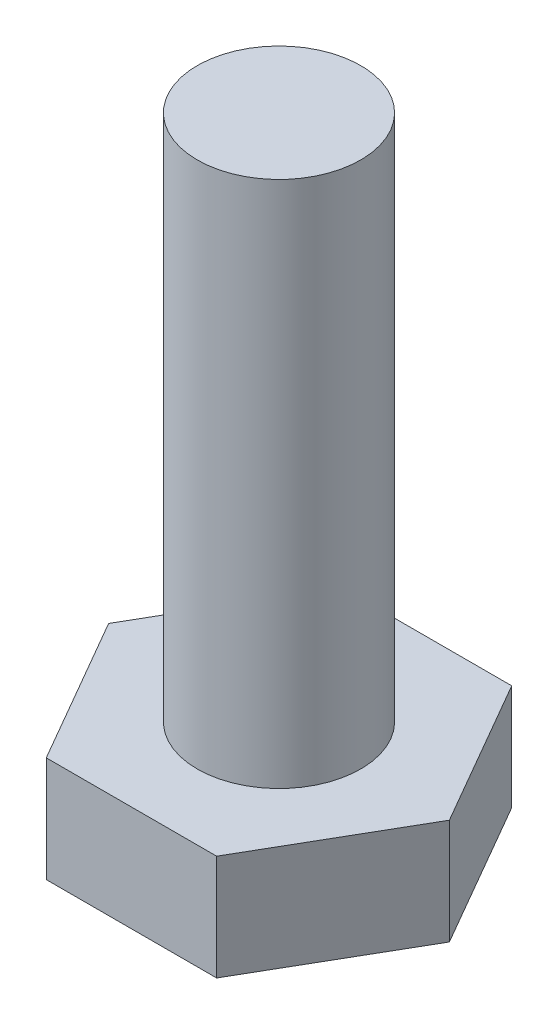
ISO-10303-21;
HEADER;
FILE_DESCRIPTION(('STEP AP214'),'2;1');
FILE_NAME('part.step','',(''),(''),'','','');
FILE_SCHEMA(('AUTOMOTIVE_DESIGN { 1 0 10303 214 1 1 1 1 }'));
ENDSEC;
DATA;
#1=APPLICATION_CONTEXT('core data for automotive mechanical design processes');
#2=APPLICATION_PROTOCOL_DEFINITION('international standard','automotive_design',2000,#1);
#3=PRODUCT_CONTEXT('',#1,'mechanical');
#4=PRODUCT('Part','Part','',(#3));
#5=PRODUCT_RELATED_PRODUCT_CATEGORY('part','',(#4));
#6=PRODUCT_DEFINITION_FORMATION('','',#4);
#7=PRODUCT_DEFINITION_CONTEXT('part definition',#1,'design');
#8=PRODUCT_DEFINITION('design','',#6,#7);
#9=PRODUCT_DEFINITION_SHAPE('','',#8);
#10=(LENGTH_UNIT() NAMED_UNIT(*) SI_UNIT(.MILLI.,.METRE.));
#11=(NAMED_UNIT(*) PLANE_ANGLE_UNIT() SI_UNIT($,.RADIAN.));
#12=(NAMED_UNIT(*) SI_UNIT($,.STERADIAN.) SOLID_ANGLE_UNIT());
#13=UNCERTAINTY_MEASURE_WITH_UNIT(LENGTH_MEASURE(1.E-05),#10,'distance_accuracy_value','');
#14=(GEOMETRIC_REPRESENTATION_CONTEXT(3) GLOBAL_UNCERTAINTY_ASSIGNED_CONTEXT((#13)) GLOBAL_UNIT_ASSIGNED_CONTEXT((#10,
#11,#12)) REPRESENTATION_CONTEXT('',''));
#15=CARTESIAN_POINT('',(0.,0.,0.));
#16=DIRECTION('',(0.,0.,1.));
#17=DIRECTION('',(1.,0.,0.));
#18=AXIS2_PLACEMENT_3D('',#15,#16,#17);
#19=CARTESIAN_POINT('',(1.61500000000003,2.,2.79726205422371));
#20=DIRECTION('',(-0.866025403784442,0.,-0.499999999999995));
#21=DIRECTION('',(-0.499999999999995,0.,0.866025403784442));
#22=AXIS2_PLACEMENT_3D('',#19,#20,#21);
#23=PLANE('',#22);
#24=DIRECTION('',(0.499999999999995,0.,-0.866025403784442));
#25=VECTOR('',#24,1.);
#26=CARTESIAN_POINT('',(1.61500000000003,0.,2.79726205422371));
#27=LINE('',#26,#25);
#28=CARTESIAN_POINT('',(1.61500000000003,0.,2.79726205422371));
#29=VERTEX_POINT('',#28);
#30=CARTESIAN_POINT('',(3.22999999999999,0.,0.));
#31=VERTEX_POINT('',#30);
#32=EDGE_CURVE('E116',#29,#31,#27,.T.);
#33=ORIENTED_EDGE('',*,*,#32,.T.);
#34=DIRECTION('',(0.,-1.,0.));
#35=VECTOR('',#34,1.);
#36=CARTESIAN_POINT('',(3.22999999999999,2.,0.));
#37=LINE('',#36,#35);
#38=CARTESIAN_POINT('',(3.22999999999999,2.,0.));
#39=VERTEX_POINT('',#38);
#40=EDGE_CURVE('E11',#39,#31,#37,.T.);
#41=ORIENTED_EDGE('',*,*,#40,.F.);
#42=DIRECTION('',(0.499999999999995,0.,-0.866025403784442));
#43=VECTOR('',#42,1.);
#44=CARTESIAN_POINT('',(1.61500000000003,2.,2.79726205422371));
#45=LINE('',#44,#43);
#46=CARTESIAN_POINT('',(1.61500000000003,2.,2.79726205422371));
#47=VERTEX_POINT('',#46);
#48=EDGE_CURVE('E127',#47,#39,#45,.T.);
#49=ORIENTED_EDGE('',*,*,#48,.F.);
#50=DIRECTION('',(0.,-1.,0.));
#51=VECTOR('',#50,1.);
#52=CARTESIAN_POINT('',(1.61500000000003,2.,2.79726205422371));
#53=LINE('',#52,#51);
#54=EDGE_CURVE('E112',#47,#29,#53,.T.);
#55=ORIENTED_EDGE('',*,*,#54,.T.);
#56=EDGE_LOOP('',(#33,#41,#49,#55));
#57=FACE_BOUND('',#56,.T.);
#58=ADVANCED_FACE('F32',(#57),#23,.F.);
#59=CARTESIAN_POINT('',(3.22999999999999,2.,0.));
#60=DIRECTION('',(-0.866025403784438,0.,0.500000000000001));
#61=DIRECTION('',(0.500000000000001,0.,0.866025403784438));
#62=AXIS2_PLACEMENT_3D('',#59,#60,#61);
#63=PLANE('',#62);
#64=DIRECTION('',(-0.500000000000001,0.,-0.866025403784438));
#65=VECTOR('',#64,1.);
#66=CARTESIAN_POINT('',(3.22999999999999,0.,0.));
#67=LINE('',#66,#65);
#68=CARTESIAN_POINT('',(1.61499999999999,0.,-2.79726205422373));
#69=VERTEX_POINT('',#68);
#70=EDGE_CURVE('E119',#31,#69,#67,.T.);
#71=ORIENTED_EDGE('',*,*,#70,.T.);
#72=DIRECTION('',(0.,-1.,0.));
#73=VECTOR('',#72,1.);
#74=CARTESIAN_POINT('',(1.61499999999999,2.,-2.79726205422373));
#75=LINE('',#74,#73);
#76=CARTESIAN_POINT('',(1.61499999999999,2.,-2.79726205422373));
#77=VERTEX_POINT('',#76);
#78=EDGE_CURVE('E40',#77,#69,#75,.T.);
#79=ORIENTED_EDGE('',*,*,#78,.F.);
#80=DIRECTION('',(-0.500000000000001,0.,-0.866025403784438));
#81=VECTOR('',#80,1.);
#82=CARTESIAN_POINT('',(3.22999999999999,2.,0.));
#83=LINE('',#82,#81);
#84=EDGE_CURVE('E85',#39,#77,#83,.T.);
#85=ORIENTED_EDGE('',*,*,#84,.F.);
#86=ORIENTED_EDGE('',*,*,#40,.T.);
#87=EDGE_LOOP('',(#71,#79,#85,#86));
#88=FACE_BOUND('',#87,.T.);
#89=ADVANCED_FACE('F152',(#88),#63,.F.);
#90=CARTESIAN_POINT('',(1.61499999999999,2.,-2.79726205422373));
#91=DIRECTION('',(0.,0.,1.));
#92=DIRECTION('',(1.,0.,0.));
#93=AXIS2_PLACEMENT_3D('',#90,#91,#92);
#94=PLANE('',#93);
#95=DIRECTION('',(-1.,0.,0.));
#96=VECTOR('',#95,1.);
#97=CARTESIAN_POINT('',(1.61499999999999,0.,-2.79726205422373));
#98=LINE('',#97,#96);
#99=CARTESIAN_POINT('',(-1.61500000000001,0.,-2.79726205422372));
#100=VERTEX_POINT('',#99);
#101=EDGE_CURVE('E122',#69,#100,#98,.T.);
#102=ORIENTED_EDGE('',*,*,#101,.T.);
#103=DIRECTION('',(0.,-1.,0.));
#104=VECTOR('',#103,1.);
#105=CARTESIAN_POINT('',(-1.61500000000001,2.,-2.79726205422372));
#106=LINE('',#105,#104);
#107=CARTESIAN_POINT('',(-1.61500000000001,2.,-2.79726205422372));
#108=VERTEX_POINT('',#107);
#109=EDGE_CURVE('E107',#108,#100,#106,.T.);
#110=ORIENTED_EDGE('',*,*,#109,.F.);
#111=DIRECTION('',(-1.,0.,0.));
#112=VECTOR('',#111,1.);
#113=CARTESIAN_POINT('',(1.61499999999999,2.,-2.79726205422373));
#114=LINE('',#113,#112);
#115=EDGE_CURVE('E98',#77,#108,#114,.T.);
#116=ORIENTED_EDGE('',*,*,#115,.F.);
#117=ORIENTED_EDGE('',*,*,#78,.T.);
#118=EDGE_LOOP('',(#102,#110,#116,#117));
#119=FACE_BOUND('',#118,.T.);
#120=ADVANCED_FACE('F133',(#119),#94,.F.);
#121=CARTESIAN_POINT('',(-1.61500000000001,2.,-2.79726205422372));
#122=DIRECTION('',(0.866025403784441,0.,0.499999999999995));
#123=DIRECTION('',(0.499999999999995,0.,-0.866025403784442));
#124=AXIS2_PLACEMENT_3D('',#121,#122,#123);
#125=PLANE('',#124);
#126=DIRECTION('',(-0.499999999999995,0.,0.866025403784441));
#127=VECTOR('',#126,1.);
#128=CARTESIAN_POINT('',(-1.61500000000001,0.,-2.79726205422372));
#129=LINE('',#128,#127);
#130=CARTESIAN_POINT('',(-3.22999999999999,0.,0.));
#131=VERTEX_POINT('',#130);
#132=EDGE_CURVE('E106',#100,#131,#129,.T.);
#133=ORIENTED_EDGE('',*,*,#132,.T.);
#134=DIRECTION('',(0.,-1.,0.));
#135=VECTOR('',#134,1.);
#136=CARTESIAN_POINT('',(-3.22999999999999,2.,0.));
#137=LINE('',#136,#135);
#138=CARTESIAN_POINT('',(-3.22999999999999,2.,0.));
#139=VERTEX_POINT('',#138);
#140=EDGE_CURVE('E103',#139,#131,#137,.T.);
#141=ORIENTED_EDGE('',*,*,#140,.F.);
#142=DIRECTION('',(-0.499999999999995,0.,0.866025403784441));
#143=VECTOR('',#142,1.);
#144=CARTESIAN_POINT('',(-1.61500000000001,2.,-2.79726205422372));
#145=LINE('',#144,#143);
#146=EDGE_CURVE('E92',#108,#139,#145,.T.);
#147=ORIENTED_EDGE('',*,*,#146,.F.);
#148=ORIENTED_EDGE('',*,*,#109,.T.);
#149=EDGE_LOOP('',(#133,#141,#147,#148));
#150=FACE_BOUND('',#149,.T.);
#151=ADVANCED_FACE('F104',(#150),#125,.F.);
#152=CARTESIAN_POINT('',(-3.22999999999999,2.,0.));
#153=DIRECTION('',(0.866025403784435,0.,-0.500000000000007));
#154=DIRECTION('',(-0.500000000000007,0.,-0.866025403784435));
#155=AXIS2_PLACEMENT_3D('',#152,#153,#154);
#156=PLANE('',#155);
#157=DIRECTION('',(0.500000000000007,0.,0.866025403784435));
#158=VECTOR('',#157,1.);
#159=CARTESIAN_POINT('',(-3.22999999999999,0.,0.));
#160=LINE('',#159,#158);
#161=CARTESIAN_POINT('',(-1.61499999999997,0.,2.79726205422375));
#162=VERTEX_POINT('',#161);
#163=EDGE_CURVE('E71',#131,#162,#160,.T.);
#164=ORIENTED_EDGE('',*,*,#163,.T.);
#165=DIRECTION('',(0.,-1.,0.));
#166=VECTOR('',#165,1.);
#167=CARTESIAN_POINT('',(-1.61499999999997,2.,2.79726205422375));
#168=LINE('',#167,#166);
#169=CARTESIAN_POINT('',(-1.61499999999997,2.,2.79726205422375));
#170=VERTEX_POINT('',#169);
#171=EDGE_CURVE('E108',#170,#162,#168,.T.);
#172=ORIENTED_EDGE('',*,*,#171,.F.);
#173=DIRECTION('',(0.500000000000007,0.,0.866025403784435));
#174=VECTOR('',#173,1.);
#175=CARTESIAN_POINT('',(-3.22999999999999,2.,0.));
#176=LINE('',#175,#174);
#177=EDGE_CURVE('E96',#139,#170,#176,.T.);
#178=ORIENTED_EDGE('',*,*,#177,.F.);
#179=ORIENTED_EDGE('',*,*,#140,.T.);
#180=EDGE_LOOP('',(#164,#172,#178,#179));
#181=FACE_BOUND('',#180,.T.);
#182=ADVANCED_FACE('F110',(#181),#156,.F.);
#183=CARTESIAN_POINT('',(-1.61499999999997,2.,2.79726205422375));
#184=DIRECTION('',(0.,0.,-1.));
#185=DIRECTION('',(-1.,0.,0.));
#186=AXIS2_PLACEMENT_3D('',#183,#184,#185);
#187=PLANE('',#186);
#188=DIRECTION('',(1.,0.,0.));
#189=VECTOR('',#188,1.);
#190=CARTESIAN_POINT('',(-1.61499999999997,0.,2.79726205422375));
#191=LINE('',#190,#189);
#192=EDGE_CURVE('E77',#162,#29,#191,.T.);
#193=ORIENTED_EDGE('',*,*,#192,.T.);
#194=ORIENTED_EDGE('',*,*,#54,.F.);
#195=DIRECTION('',(1.,0.,0.));
#196=VECTOR('',#195,1.);
#197=CARTESIAN_POINT('',(-1.61499999999997,2.,2.79726205422375));
#198=LINE('',#197,#196);
#199=EDGE_CURVE('E48',#170,#47,#198,.T.);
#200=ORIENTED_EDGE('',*,*,#199,.F.);
#201=ORIENTED_EDGE('',*,*,#171,.T.);
#202=EDGE_LOOP('',(#193,#194,#200,#201));
#203=FACE_BOUND('',#202,.T.);
#204=ADVANCED_FACE('F140',(#203),#187,.F.);
#205=CARTESIAN_POINT('',(0.,2.,0.));
#206=DIRECTION('',(0.,1.,0.));
#207=DIRECTION('',(0.,0.,1.));
#208=AXIS2_PLACEMENT_3D('',#205,#206,#207);
#209=PLANE('',#208);
#210=CARTESIAN_POINT('',(0.,2.,0.));
#211=DIRECTION('',(0.,1.,0.));
#212=DIRECTION('',(0.,0.,1.));
#213=AXIS2_PLACEMENT_3D('',#210,#211,#212);
#214=CIRCLE('',#213,1.55);
#215=CARTESIAN_POINT('',(0.,2.,1.55));
#216=VERTEX_POINT('',#215);
#217=EDGE_CURVE('E213',#216,#216,#214,.T.);
#218=ORIENTED_EDGE('',*,*,#217,.F.);
#219=EDGE_LOOP('',(#218));
#220=FACE_BOUND('',#219,.T.);
#221=ORIENTED_EDGE('',*,*,#48,.T.);
#222=ORIENTED_EDGE('',*,*,#84,.T.);
#223=ORIENTED_EDGE('',*,*,#115,.T.);
#224=ORIENTED_EDGE('',*,*,#146,.T.);
#225=ORIENTED_EDGE('',*,*,#177,.T.);
#226=ORIENTED_EDGE('',*,*,#199,.T.);
#227=EDGE_LOOP('',(#221,#222,#223,#224,#225,#226));
#228=FACE_BOUND('',#227,.T.);
#229=ADVANCED_FACE('F94',(#220,#228),#209,.T.);
#230=CARTESIAN_POINT('',(0.,0.,0.));
#231=DIRECTION('',(0.,1.,0.));
#232=DIRECTION('',(0.,0.,1.));
#233=AXIS2_PLACEMENT_3D('',#230,#231,#232);
#234=PLANE('',#233);
#235=ORIENTED_EDGE('',*,*,#32,.F.);
#236=ORIENTED_EDGE('',*,*,#192,.F.);
#237=ORIENTED_EDGE('',*,*,#163,.F.);
#238=ORIENTED_EDGE('',*,*,#132,.F.);
#239=ORIENTED_EDGE('',*,*,#101,.F.);
#240=ORIENTED_EDGE('',*,*,#70,.F.);
#241=EDGE_LOOP('',(#235,#236,#237,#238,#239,#240));
#242=FACE_BOUND('',#241,.T.);
#243=ADVANCED_FACE('F136',(#242),#234,.F.);
#244=CARTESIAN_POINT('',(0.,12.,0.));
#245=DIRECTION('',(0.,-1.,0.));
#246=DIRECTION('',(0.,0.,-1.));
#247=AXIS2_PLACEMENT_3D('',#244,#245,#246);
#248=CYLINDRICAL_SURFACE('',#247,1.55);
#249=CARTESIAN_POINT('',(0.,12.,0.));
#250=DIRECTION('',(0.,1.,0.));
#251=DIRECTION('',(0.,0.,1.));
#252=AXIS2_PLACEMENT_3D('',#249,#250,#251);
#253=CIRCLE('',#252,1.55);
#254=CARTESIAN_POINT('',(0.,12.,1.55));
#255=VERTEX_POINT('',#254);
#256=EDGE_CURVE('E120',#255,#255,#253,.T.);
#257=ORIENTED_EDGE('',*,*,#256,.F.);
#258=EDGE_LOOP('',(#257));
#259=FACE_BOUND('',#258,.T.);
#260=ORIENTED_EDGE('',*,*,#217,.T.);
#261=EDGE_LOOP('',(#260));
#262=FACE_BOUND('',#261,.T.);
#263=ADVANCED_FACE('F184',(#259,#262),#248,.T.);
#264=CARTESIAN_POINT('',(0.,12.,0.));
#265=DIRECTION('',(0.,1.,0.));
#266=DIRECTION('',(0.,0.,1.));
#267=AXIS2_PLACEMENT_3D('',#264,#265,#266);
#268=PLANE('',#267);
#269=ORIENTED_EDGE('',*,*,#256,.T.);
#270=EDGE_LOOP('',(#269));
#271=FACE_BOUND('',#270,.T.);
#272=ADVANCED_FACE('F197',(#271),#268,.T.);
#273=CLOSED_SHELL('',(#58,#89,#120,#151,#182,#204,#229,#243,#263,#272));
#274=MANIFOLD_SOLID_BREP('B2',#273);
#275=ADVANCED_BREP_SHAPE_REPRESENTATION('',(#18,#274),#14);
#276=SHAPE_DEFINITION_REPRESENTATION(#9,#275);
ENDSEC;
END-ISO-10303-21;
